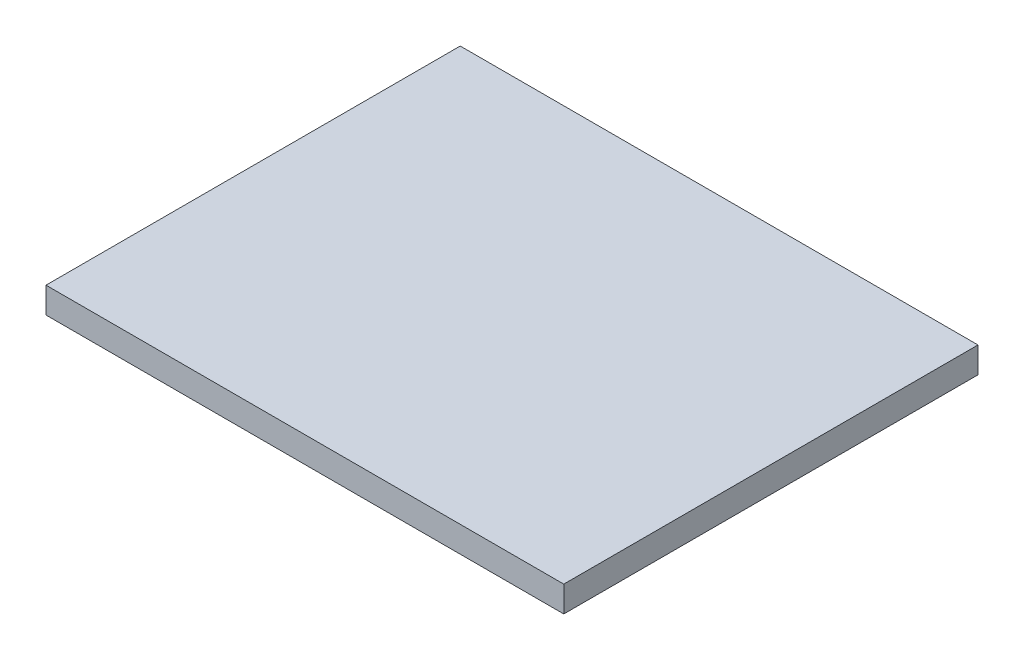
ISO-10303-21;
HEADER;
FILE_DESCRIPTION(('STEP AP214'),'2;1');
FILE_NAME('part.step','',(''),(''),'','','');
FILE_SCHEMA(('AUTOMOTIVE_DESIGN { 1 0 10303 214 1 1 1 1 }'));
ENDSEC;
DATA;
#1=APPLICATION_CONTEXT('core data for automotive mechanical design processes');
#2=APPLICATION_PROTOCOL_DEFINITION('international standard','automotive_design',2000,#1);
#3=PRODUCT_CONTEXT('',#1,'mechanical');
#4=PRODUCT('Part','Part','',(#3));
#5=PRODUCT_RELATED_PRODUCT_CATEGORY('part','',(#4));
#6=PRODUCT_DEFINITION_FORMATION('','',#4);
#7=PRODUCT_DEFINITION_CONTEXT('part definition',#1,'design');
#8=PRODUCT_DEFINITION('design','',#6,#7);
#9=PRODUCT_DEFINITION_SHAPE('','',#8);
#10=(LENGTH_UNIT() NAMED_UNIT(*) SI_UNIT(.MILLI.,.METRE.));
#11=(NAMED_UNIT(*) PLANE_ANGLE_UNIT() SI_UNIT($,.RADIAN.));
#12=(NAMED_UNIT(*) SI_UNIT($,.STERADIAN.) SOLID_ANGLE_UNIT());
#13=UNCERTAINTY_MEASURE_WITH_UNIT(LENGTH_MEASURE(1.E-05),#10,'distance_accuracy_value','');
#14=(GEOMETRIC_REPRESENTATION_CONTEXT(3) GLOBAL_UNCERTAINTY_ASSIGNED_CONTEXT((#13)) GLOBAL_UNIT_ASSIGNED_CONTEXT((#10,
#11,#12)) REPRESENTATION_CONTEXT('',''));
#15=CARTESIAN_POINT('',(0.,0.,0.));
#16=DIRECTION('',(0.,0.,1.));
#17=DIRECTION('',(1.,0.,0.));
#18=AXIS2_PLACEMENT_3D('',#15,#16,#17);
#19=CARTESIAN_POINT('',(0.,6.35,0.));
#20=DIRECTION('',(0.,1.,0.));
#21=DIRECTION('',(0.,0.,1.));
#22=AXIS2_PLACEMENT_3D('',#19,#20,#21);
#23=PLANE('',#22);
#24=DIRECTION('',(0.,0.,-1.));
#25=VECTOR('',#24,1.);
#26=CARTESIAN_POINT('',(63.5,6.35,-50.8));
#27=LINE('',#26,#25);
#28=CARTESIAN_POINT('',(63.5,6.35,50.8));
#29=VERTEX_POINT('',#28);
#30=CARTESIAN_POINT('',(63.5,6.35,-50.8));
#31=VERTEX_POINT('',#30);
#32=EDGE_CURVE('E97',#29,#31,#27,.T.);
#33=ORIENTED_EDGE('',*,*,#32,.T.);
#34=DIRECTION('',(-1.,0.,0.));
#35=VECTOR('',#34,1.);
#36=CARTESIAN_POINT('',(-63.5,6.35,-50.8));
#37=LINE('',#36,#35);
#38=CARTESIAN_POINT('',(-63.5,6.35,-50.8));
#39=VERTEX_POINT('',#38);
#40=EDGE_CURVE('E93',#31,#39,#37,.T.);
#41=ORIENTED_EDGE('',*,*,#40,.T.);
#42=DIRECTION('',(0.,0.,1.));
#43=VECTOR('',#42,1.);
#44=CARTESIAN_POINT('',(-63.5,6.35,-50.8));
#45=LINE('',#44,#43);
#46=CARTESIAN_POINT('',(-63.5,6.35,50.8));
#47=VERTEX_POINT('',#46);
#48=EDGE_CURVE('E95',#39,#47,#45,.T.);
#49=ORIENTED_EDGE('',*,*,#48,.T.);
#50=DIRECTION('',(1.,0.,0.));
#51=VECTOR('',#50,1.);
#52=CARTESIAN_POINT('',(-63.5,6.35,50.8));
#53=LINE('',#52,#51);
#54=EDGE_CURVE('E63',#47,#29,#53,.T.);
#55=ORIENTED_EDGE('',*,*,#54,.T.);
#56=EDGE_LOOP('',(#33,#41,#49,#55));
#57=FACE_BOUND('',#56,.T.);
#58=ADVANCED_FACE('F45',(#57),#23,.T.);
#59=CARTESIAN_POINT('',(0.,0.,0.));
#60=DIRECTION('',(0.,1.,0.));
#61=DIRECTION('',(0.,0.,1.));
#62=AXIS2_PLACEMENT_3D('',#59,#60,#61);
#63=PLANE('',#62);
#64=DIRECTION('',(0.,0.,-1.));
#65=VECTOR('',#64,1.);
#66=CARTESIAN_POINT('',(63.5,0.,-50.8));
#67=LINE('',#66,#65);
#68=CARTESIAN_POINT('',(63.5,0.,50.8));
#69=VERTEX_POINT('',#68);
#70=CARTESIAN_POINT('',(63.5,0.,-50.8));
#71=VERTEX_POINT('',#70);
#72=EDGE_CURVE('E113',#69,#71,#67,.T.);
#73=ORIENTED_EDGE('',*,*,#72,.F.);
#74=DIRECTION('',(1.,0.,0.));
#75=VECTOR('',#74,1.);
#76=CARTESIAN_POINT('',(-63.5,0.,50.8));
#77=LINE('',#76,#75);
#78=CARTESIAN_POINT('',(-63.5,0.,50.8));
#79=VERTEX_POINT('',#78);
#80=EDGE_CURVE('E86',#79,#69,#77,.T.);
#81=ORIENTED_EDGE('',*,*,#80,.F.);
#82=DIRECTION('',(0.,0.,1.));
#83=VECTOR('',#82,1.);
#84=CARTESIAN_POINT('',(-63.5,0.,-50.8));
#85=LINE('',#84,#83);
#86=CARTESIAN_POINT('',(-63.5,0.,-50.8));
#87=VERTEX_POINT('',#86);
#88=EDGE_CURVE('E80',#87,#79,#85,.T.);
#89=ORIENTED_EDGE('',*,*,#88,.F.);
#90=DIRECTION('',(-1.,0.,0.));
#91=VECTOR('',#90,1.);
#92=CARTESIAN_POINT('',(-63.5,0.,-50.8));
#93=LINE('',#92,#91);
#94=EDGE_CURVE('E102',#71,#87,#93,.T.);
#95=ORIENTED_EDGE('',*,*,#94,.F.);
#96=EDGE_LOOP('',(#73,#81,#89,#95));
#97=FACE_BOUND('',#96,.T.);
#98=ADVANCED_FACE('F129',(#97),#63,.F.);
#99=CARTESIAN_POINT('',(63.5,6.35,-50.8));
#100=DIRECTION('',(-1.,0.,0.));
#101=DIRECTION('',(0.,0.,1.));
#102=AXIS2_PLACEMENT_3D('',#99,#100,#101);
#103=PLANE('',#102);
#104=ORIENTED_EDGE('',*,*,#72,.T.);
#105=DIRECTION('',(0.,-1.,0.));
#106=VECTOR('',#105,1.);
#107=CARTESIAN_POINT('',(63.5,6.35,-50.8));
#108=LINE('',#107,#106);
#109=EDGE_CURVE('E11',#31,#71,#108,.T.);
#110=ORIENTED_EDGE('',*,*,#109,.F.);
#111=ORIENTED_EDGE('',*,*,#32,.F.);
#112=DIRECTION('',(0.,-1.,0.));
#113=VECTOR('',#112,1.);
#114=CARTESIAN_POINT('',(63.5,6.35,50.8));
#115=LINE('',#114,#113);
#116=EDGE_CURVE('E109',#29,#69,#115,.T.);
#117=ORIENTED_EDGE('',*,*,#116,.T.);
#118=EDGE_LOOP('',(#104,#110,#111,#117));
#119=FACE_BOUND('',#118,.T.);
#120=ADVANCED_FACE('F47',(#119),#103,.F.);
#121=CARTESIAN_POINT('',(-63.5,6.35,-50.8));
#122=DIRECTION('',(0.,0.,1.));
#123=DIRECTION('',(1.,0.,0.));
#124=AXIS2_PLACEMENT_3D('',#121,#122,#123);
#125=PLANE('',#124);
#126=ORIENTED_EDGE('',*,*,#94,.T.);
#127=DIRECTION('',(0.,-1.,0.));
#128=VECTOR('',#127,1.);
#129=CARTESIAN_POINT('',(-63.5,6.35,-50.8));
#130=LINE('',#129,#128);
#131=EDGE_CURVE('E55',#39,#87,#130,.T.);
#132=ORIENTED_EDGE('',*,*,#131,.F.);
#133=ORIENTED_EDGE('',*,*,#40,.F.);
#134=ORIENTED_EDGE('',*,*,#109,.T.);
#135=EDGE_LOOP('',(#126,#132,#133,#134));
#136=FACE_BOUND('',#135,.T.);
#137=ADVANCED_FACE('F101',(#136),#125,.F.);
#138=CARTESIAN_POINT('',(-63.5,6.35,-50.8));
#139=DIRECTION('',(1.,0.,0.));
#140=DIRECTION('',(0.,0.,-1.));
#141=AXIS2_PLACEMENT_3D('',#138,#139,#140);
#142=PLANE('',#141);
#143=ORIENTED_EDGE('',*,*,#88,.T.);
#144=DIRECTION('',(0.,-1.,0.));
#145=VECTOR('',#144,1.);
#146=CARTESIAN_POINT('',(-63.5,6.35,50.8));
#147=LINE('',#146,#145);
#148=EDGE_CURVE('E104',#47,#79,#147,.T.);
#149=ORIENTED_EDGE('',*,*,#148,.F.);
#150=ORIENTED_EDGE('',*,*,#48,.F.);
#151=ORIENTED_EDGE('',*,*,#131,.T.);
#152=EDGE_LOOP('',(#143,#149,#150,#151));
#153=FACE_BOUND('',#152,.T.);
#154=ADVANCED_FACE('F105',(#153),#142,.F.);
#155=CARTESIAN_POINT('',(-63.5,6.35,50.8));
#156=DIRECTION('',(0.,0.,-1.));
#157=DIRECTION('',(-1.,0.,0.));
#158=AXIS2_PLACEMENT_3D('',#155,#156,#157);
#159=PLANE('',#158);
#160=ORIENTED_EDGE('',*,*,#80,.T.);
#161=ORIENTED_EDGE('',*,*,#116,.F.);
#162=ORIENTED_EDGE('',*,*,#54,.F.);
#163=ORIENTED_EDGE('',*,*,#148,.T.);
#164=EDGE_LOOP('',(#160,#161,#162,#163));
#165=FACE_BOUND('',#164,.T.);
#166=ADVANCED_FACE('F126',(#165),#159,.F.);
#167=CLOSED_SHELL('',(#58,#98,#120,#137,#154,#166));
#168=MANIFOLD_SOLID_BREP('B2',#167);
#169=ADVANCED_BREP_SHAPE_REPRESENTATION('',(#18,#168),#14);
#170=SHAPE_DEFINITION_REPRESENTATION(#9,#169);
ENDSEC;
END-ISO-10303-21;
